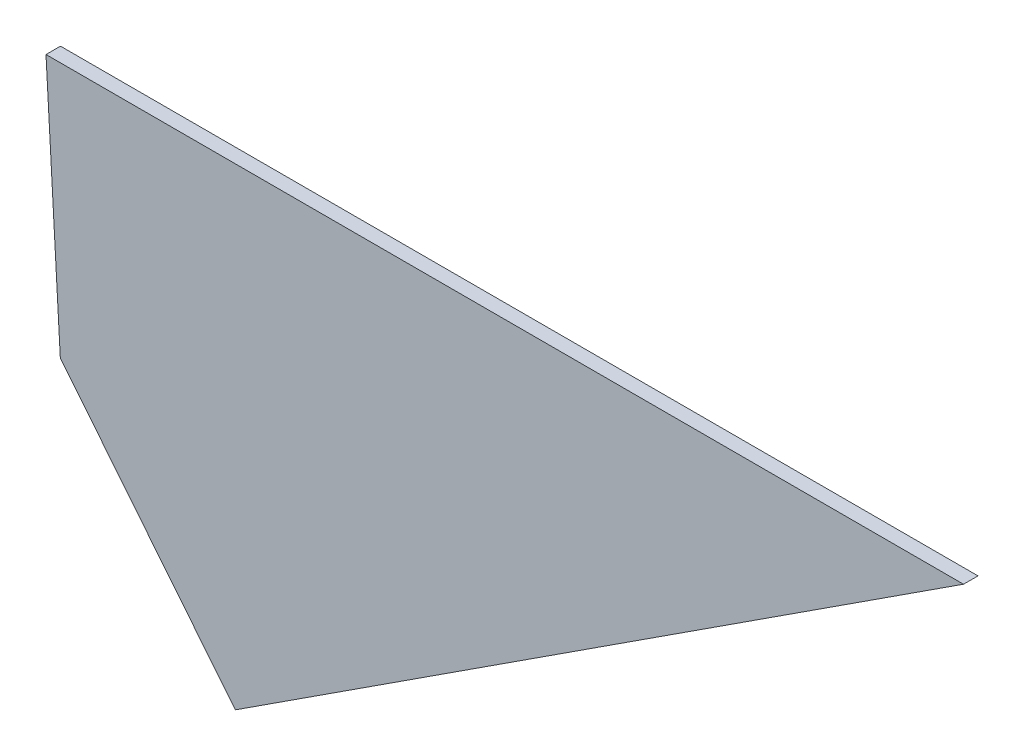
ISO-10303-21;
HEADER;
FILE_DESCRIPTION(('STEP AP214'),'2;1');
FILE_NAME('part.step','',(''),(''),'','','');
FILE_SCHEMA(('AUTOMOTIVE_DESIGN { 1 0 10303 214 1 1 1 1 }'));
ENDSEC;
DATA;
#1=APPLICATION_CONTEXT('core data for automotive mechanical design processes');
#2=APPLICATION_PROTOCOL_DEFINITION('international standard','automotive_design',2000,#1);
#3=PRODUCT_CONTEXT('',#1,'mechanical');
#4=PRODUCT('Part','Part','',(#3));
#5=PRODUCT_RELATED_PRODUCT_CATEGORY('part','',(#4));
#6=PRODUCT_DEFINITION_FORMATION('','',#4);
#7=PRODUCT_DEFINITION_CONTEXT('part definition',#1,'design');
#8=PRODUCT_DEFINITION('design','',#6,#7);
#9=PRODUCT_DEFINITION_SHAPE('','',#8);
#10=(LENGTH_UNIT() NAMED_UNIT(*) SI_UNIT(.MILLI.,.METRE.));
#11=(NAMED_UNIT(*) PLANE_ANGLE_UNIT() SI_UNIT($,.RADIAN.));
#12=(NAMED_UNIT(*) SI_UNIT($,.STERADIAN.) SOLID_ANGLE_UNIT());
#13=UNCERTAINTY_MEASURE_WITH_UNIT(LENGTH_MEASURE(1.E-05),#10,'distance_accuracy_value','');
#14=(GEOMETRIC_REPRESENTATION_CONTEXT(3) GLOBAL_UNCERTAINTY_ASSIGNED_CONTEXT((#13)) GLOBAL_UNIT_ASSIGNED_CONTEXT((#10,
#11,#12)) REPRESENTATION_CONTEXT('',''));
#15=CARTESIAN_POINT('',(0.,0.,0.));
#16=DIRECTION('',(0.,0.,1.));
#17=DIRECTION('',(1.,0.,0.));
#18=AXIS2_PLACEMENT_3D('',#15,#16,#17);
#19=CARTESIAN_POINT('',(58.687618568316,-38.6363273857961,-3.));
#20=DIRECTION('',(0.544639035015023,-0.838670567945427,0.));
#21=DIRECTION('',(0.838670567945427,0.544639035015023,0.));
#22=AXIS2_PLACEMENT_3D('',#19,#20,#21);
#23=PLANE('',#22);
#24=DIRECTION('',(0.838670567945427,0.544639035015022,0.));
#25=VECTOR('',#24,1.);
#26=CARTESIAN_POINT('',(58.687618568316,-38.6363273857961,0.));
#27=LINE('',#26,#25);
#28=CARTESIAN_POINT('',(-92.2730836618609,-136.6713536885,0.));
#29=VERTEX_POINT('',#28);
#30=CARTESIAN_POINT('',(58.687618568316,-38.6363273857961,0.));
#31=VERTEX_POINT('',#30);
#32=EDGE_CURVE('E93',#29,#31,#27,.T.);
#33=ORIENTED_EDGE('',*,*,#32,.F.);
#34=DIRECTION('',(0.,0.,1.));
#35=VECTOR('',#34,1.);
#36=CARTESIAN_POINT('',(-92.2730836618609,-136.6713536885,-3.));
#37=LINE('',#36,#35);
#38=CARTESIAN_POINT('',(-92.2730836618609,-136.6713536885,-3.));
#39=VERTEX_POINT('',#38);
#40=EDGE_CURVE('E42',#39,#29,#37,.T.);
#41=ORIENTED_EDGE('',*,*,#40,.F.);
#42=DIRECTION('',(0.838670567945427,0.544639035015022,0.));
#43=VECTOR('',#42,1.);
#44=CARTESIAN_POINT('',(58.687618568316,-38.6363273857961,-3.));
#45=LINE('',#44,#43);
#46=CARTESIAN_POINT('',(58.687618568316,-38.6363273857961,-3.));
#47=VERTEX_POINT('',#46);
#48=EDGE_CURVE('E89',#39,#47,#45,.T.);
#49=ORIENTED_EDGE('',*,*,#48,.T.);
#50=DIRECTION('',(0.,0.,1.));
#51=VECTOR('',#50,1.);
#52=CARTESIAN_POINT('',(58.687618568316,-38.6363273857961,-3.));
#53=LINE('',#52,#51);
#54=EDGE_CURVE('E11',#47,#31,#53,.T.);
#55=ORIENTED_EDGE('',*,*,#54,.T.);
#56=EDGE_LOOP('',(#33,#41,#49,#55));
#57=FACE_BOUND('',#56,.T.);
#58=ADVANCED_FACE('F32',(#57),#23,.T.);
#59=CARTESIAN_POINT('',(-92.2730836618609,-136.6713536885,-3.));
#60=DIRECTION('',(-0.778771159684288,-0.627308122730759,0.));
#61=DIRECTION('',(0.627308122730759,-0.778771159684288,0.));
#62=AXIS2_PLACEMENT_3D('',#59,#60,#61);
#63=PLANE('',#62);
#64=DIRECTION('',(0.627308122730759,-0.778771159684288,0.));
#65=VECTOR('',#64,1.);
#66=CARTESIAN_POINT('',(-92.2730836618609,-136.6713536885,0.));
#67=LINE('',#66,#65);
#68=CARTESIAN_POINT('',(-128.556325482799,-91.6275525864293,0.));
#69=VERTEX_POINT('',#68);
#70=EDGE_CURVE('E78',#69,#29,#67,.T.);
#71=ORIENTED_EDGE('',*,*,#70,.F.);
#72=DIRECTION('',(0.,0.,1.));
#73=VECTOR('',#72,1.);
#74=CARTESIAN_POINT('',(-128.556325482799,-91.6275525864293,-3.));
#75=LINE('',#74,#73);
#76=CARTESIAN_POINT('',(-128.556325482799,-91.6275525864293,-3.));
#77=VERTEX_POINT('',#76);
#78=EDGE_CURVE('E74',#77,#69,#75,.T.);
#79=ORIENTED_EDGE('',*,*,#78,.F.);
#80=DIRECTION('',(0.627308122730758,-0.778771159684289,0.));
#81=VECTOR('',#80,1.);
#82=CARTESIAN_POINT('',(-128.556325482799,-91.6275525864293,-3.));
#83=LINE('',#82,#81);
#84=EDGE_CURVE('E77',#77,#39,#83,.T.);
#85=ORIENTED_EDGE('',*,*,#84,.T.);
#86=ORIENTED_EDGE('',*,*,#40,.T.);
#87=EDGE_LOOP('',(#71,#79,#85,#86));
#88=FACE_BOUND('',#87,.T.);
#89=ADVANCED_FACE('F76',(#88),#63,.T.);
#90=CARTESIAN_POINT('',(-131.522785252702,-38.6363273857961,-3.));
#91=DIRECTION('',(-0.998436781331136,-0.0558926979588728,0.));
#92=DIRECTION('',(0.0558926979588728,-0.998436781331136,0.));
#93=AXIS2_PLACEMENT_3D('',#90,#91,#92);
#94=PLANE('',#93);
#95=DIRECTION('',(0.0558926979588728,-0.998436781331136,0.));
#96=VECTOR('',#95,1.);
#97=CARTESIAN_POINT('',(-131.522785252702,-38.6363273857961,0.));
#98=LINE('',#97,#96);
#99=CARTESIAN_POINT('',(-131.522785252702,-38.6363273857961,0.));
#100=VERTEX_POINT('',#99);
#101=EDGE_CURVE('E98',#100,#69,#98,.T.);
#102=ORIENTED_EDGE('',*,*,#101,.F.);
#103=DIRECTION('',(0.,0.,1.));
#104=VECTOR('',#103,1.);
#105=CARTESIAN_POINT('',(-131.522785252702,-38.6363273857961,-3.));
#106=LINE('',#105,#104);
#107=CARTESIAN_POINT('',(-131.522785252702,-38.6363273857961,-3.));
#108=VERTEX_POINT('',#107);
#109=EDGE_CURVE('E36',#108,#100,#106,.T.);
#110=ORIENTED_EDGE('',*,*,#109,.F.);
#111=DIRECTION('',(0.0558926979588728,-0.998436781331136,0.));
#112=VECTOR('',#111,1.);
#113=CARTESIAN_POINT('',(-131.522785252702,-38.6363273857961,-3.));
#114=LINE('',#113,#112);
#115=EDGE_CURVE('E87',#108,#77,#114,.T.);
#116=ORIENTED_EDGE('',*,*,#115,.T.);
#117=ORIENTED_EDGE('',*,*,#78,.T.);
#118=EDGE_LOOP('',(#102,#110,#116,#117));
#119=FACE_BOUND('',#118,.T.);
#120=ADVANCED_FACE('F91',(#119),#94,.T.);
#121=CARTESIAN_POINT('',(-128.51808825426,-38.6363273857961,-3.));
#122=DIRECTION('',(0.,1.,0.));
#123=DIRECTION('',(-1.,0.,0.));
#124=AXIS2_PLACEMENT_3D('',#121,#122,#123);
#125=PLANE('',#124);
#126=DIRECTION('',(-1.,0.,0.));
#127=VECTOR('',#126,1.);
#128=CARTESIAN_POINT('',(-128.51808825426,-38.6363273857961,0.));
#129=LINE('',#128,#127);
#130=EDGE_CURVE('E68',#31,#100,#129,.T.);
#131=ORIENTED_EDGE('',*,*,#130,.F.);
#132=ORIENTED_EDGE('',*,*,#54,.F.);
#133=DIRECTION('',(-1.,0.,0.));
#134=VECTOR('',#133,1.);
#135=CARTESIAN_POINT('',(-128.51808825426,-38.6363273857961,-3.));
#136=LINE('',#135,#134);
#137=EDGE_CURVE('E70',#47,#108,#136,.T.);
#138=ORIENTED_EDGE('',*,*,#137,.T.);
#139=ORIENTED_EDGE('',*,*,#109,.T.);
#140=EDGE_LOOP('',(#131,#132,#138,#139));
#141=FACE_BOUND('',#140,.T.);
#142=ADVANCED_FACE('F34',(#141),#125,.T.);
#143=CARTESIAN_POINT('',(0.,0.,-3.));
#144=DIRECTION('',(0.,0.,-1.));
#145=DIRECTION('',(-1.,0.,0.));
#146=AXIS2_PLACEMENT_3D('',#143,#144,#145);
#147=PLANE('',#146);
#148=ORIENTED_EDGE('',*,*,#137,.F.);
#149=ORIENTED_EDGE('',*,*,#48,.F.);
#150=ORIENTED_EDGE('',*,*,#84,.F.);
#151=ORIENTED_EDGE('',*,*,#115,.F.);
#152=EDGE_LOOP('',(#148,#149,#150,#151));
#153=FACE_BOUND('',#152,.T.);
#154=ADVANCED_FACE('F86',(#153),#147,.T.);
#155=CARTESIAN_POINT('',(0.,0.,0.));
#156=DIRECTION('',(0.,0.,-1.));
#157=DIRECTION('',(-1.,0.,0.));
#158=AXIS2_PLACEMENT_3D('',#155,#156,#157);
#159=PLANE('',#158);
#160=ORIENTED_EDGE('',*,*,#32,.T.);
#161=ORIENTED_EDGE('',*,*,#130,.T.);
#162=ORIENTED_EDGE('',*,*,#101,.T.);
#163=ORIENTED_EDGE('',*,*,#70,.T.);
#164=EDGE_LOOP('',(#160,#161,#162,#163));
#165=FACE_BOUND('',#164,.T.);
#166=ADVANCED_FACE('F105',(#165),#159,.F.);
#167=CLOSED_SHELL('',(#58,#89,#120,#142,#154,#166));
#168=MANIFOLD_SOLID_BREP('B2',#167);
#169=ADVANCED_BREP_SHAPE_REPRESENTATION('',(#18,#168),#14);
#170=SHAPE_DEFINITION_REPRESENTATION(#9,#169);
ENDSEC;
END-ISO-10303-21;
